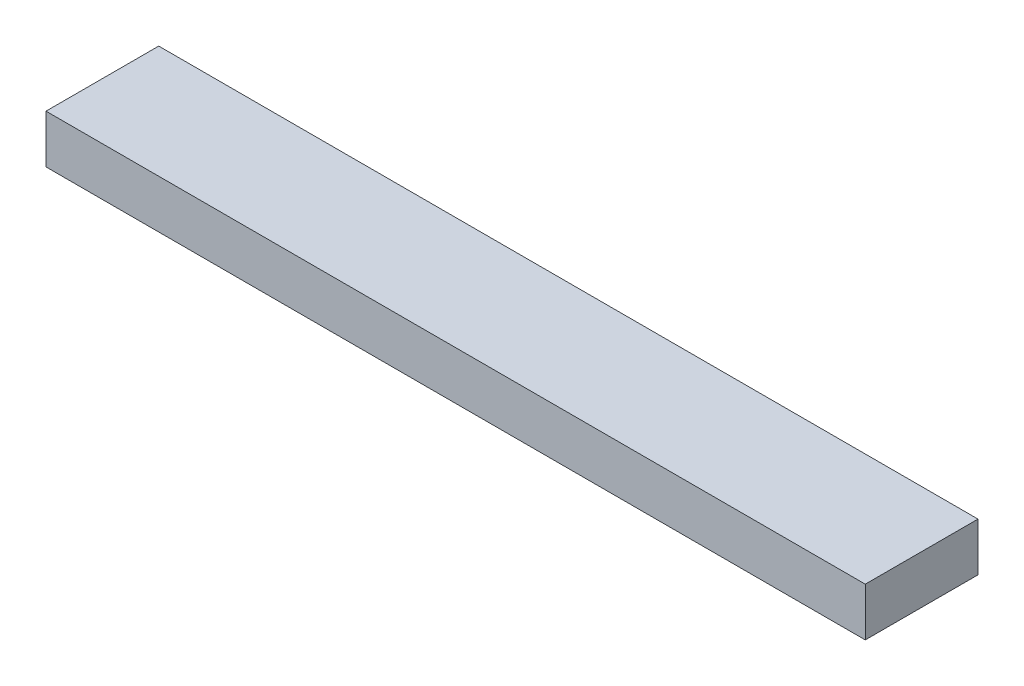
ISO-10303-21;
HEADER;
FILE_DESCRIPTION(('STEP AP214'),'2;1');
FILE_NAME('part.step','',(''),(''),'','','');
FILE_SCHEMA(('AUTOMOTIVE_DESIGN { 1 0 10303 214 1 1 1 1 }'));
ENDSEC;
DATA;
#1=APPLICATION_CONTEXT('core data for automotive mechanical design processes');
#2=APPLICATION_PROTOCOL_DEFINITION('international standard','automotive_design',2000,#1);
#3=PRODUCT_CONTEXT('',#1,'mechanical');
#4=PRODUCT('Part','Part','',(#3));
#5=PRODUCT_RELATED_PRODUCT_CATEGORY('part','',(#4));
#6=PRODUCT_DEFINITION_FORMATION('','',#4);
#7=PRODUCT_DEFINITION_CONTEXT('part definition',#1,'design');
#8=PRODUCT_DEFINITION('design','',#6,#7);
#9=PRODUCT_DEFINITION_SHAPE('','',#8);
#10=(LENGTH_UNIT() NAMED_UNIT(*) SI_UNIT(.MILLI.,.METRE.));
#11=(NAMED_UNIT(*) PLANE_ANGLE_UNIT() SI_UNIT($,.RADIAN.));
#12=(NAMED_UNIT(*) SI_UNIT($,.STERADIAN.) SOLID_ANGLE_UNIT());
#13=UNCERTAINTY_MEASURE_WITH_UNIT(LENGTH_MEASURE(1.E-05),#10,'distance_accuracy_value','');
#14=(GEOMETRIC_REPRESENTATION_CONTEXT(3) GLOBAL_UNCERTAINTY_ASSIGNED_CONTEXT((#13)) GLOBAL_UNIT_ASSIGNED_CONTEXT((#10,
#11,#12)) REPRESENTATION_CONTEXT('',''));
#15=CARTESIAN_POINT('',(0.,0.,0.));
#16=DIRECTION('',(0.,0.,1.));
#17=DIRECTION('',(1.,0.,0.));
#18=AXIS2_PLACEMENT_3D('',#15,#16,#17);
#19=CARTESIAN_POINT('',(0.,38.1,0.));
#20=DIRECTION('',(1.,0.,0.));
#21=DIRECTION('',(0.,0.,-1.));
#22=AXIS2_PLACEMENT_3D('',#19,#20,#21);
#23=PLANE('',#22);
#24=DIRECTION('',(0.,0.,1.));
#25=VECTOR('',#24,1.);
#26=CARTESIAN_POINT('',(0.,0.,0.));
#27=LINE('',#26,#25);
#28=CARTESIAN_POINT('',(0.,0.,-88.9));
#29=VERTEX_POINT('',#28);
#30=CARTESIAN_POINT('',(0.,0.,0.));
#31=VERTEX_POINT('',#30);
#32=EDGE_CURVE('E110',#29,#31,#27,.T.);
#33=ORIENTED_EDGE('',*,*,#32,.T.);
#34=DIRECTION('',(0.,-1.,0.));
#35=VECTOR('',#34,1.);
#36=CARTESIAN_POINT('',(0.,38.1,0.));
#37=LINE('',#36,#35);
#38=CARTESIAN_POINT('',(0.,38.1,0.));
#39=VERTEX_POINT('',#38);
#40=EDGE_CURVE('E11',#39,#31,#37,.T.);
#41=ORIENTED_EDGE('',*,*,#40,.F.);
#42=DIRECTION('',(0.,0.,1.));
#43=VECTOR('',#42,1.);
#44=CARTESIAN_POINT('',(0.,38.1,0.));
#45=LINE('',#44,#43);
#46=CARTESIAN_POINT('',(0.,38.1,-88.9));
#47=VERTEX_POINT('',#46);
#48=EDGE_CURVE('E93',#47,#39,#45,.T.);
#49=ORIENTED_EDGE('',*,*,#48,.F.);
#50=DIRECTION('',(0.,-1.,0.));
#51=VECTOR('',#50,1.);
#52=CARTESIAN_POINT('',(0.,38.1,-88.9));
#53=LINE('',#52,#51);
#54=EDGE_CURVE('E106',#47,#29,#53,.T.);
#55=ORIENTED_EDGE('',*,*,#54,.T.);
#56=EDGE_LOOP('',(#33,#41,#49,#55));
#57=FACE_BOUND('',#56,.T.);
#58=ADVANCED_FACE('F41',(#57),#23,.F.);
#59=CARTESIAN_POINT('',(0.,38.1,0.));
#60=DIRECTION('',(0.,0.,-1.));
#61=DIRECTION('',(-1.,0.,0.));
#62=AXIS2_PLACEMENT_3D('',#59,#60,#61);
#63=PLANE('',#62);
#64=DIRECTION('',(1.,0.,0.));
#65=VECTOR('',#64,1.);
#66=CARTESIAN_POINT('',(0.,0.,0.));
#67=LINE('',#66,#65);
#68=CARTESIAN_POINT('',(646.1125,0.,0.));
#69=VERTEX_POINT('',#68);
#70=EDGE_CURVE('E98',#31,#69,#67,.T.);
#71=ORIENTED_EDGE('',*,*,#70,.T.);
#72=DIRECTION('',(0.,-1.,0.));
#73=VECTOR('',#72,1.);
#74=CARTESIAN_POINT('',(646.1125,38.1,0.));
#75=LINE('',#74,#73);
#76=CARTESIAN_POINT('',(646.1125,38.1,0.));
#77=VERTEX_POINT('',#76);
#78=EDGE_CURVE('E50',#77,#69,#75,.T.);
#79=ORIENTED_EDGE('',*,*,#78,.F.);
#80=DIRECTION('',(1.,0.,0.));
#81=VECTOR('',#80,1.);
#82=CARTESIAN_POINT('',(0.,38.1,0.));
#83=LINE('',#82,#81);
#84=EDGE_CURVE('E88',#39,#77,#83,.T.);
#85=ORIENTED_EDGE('',*,*,#84,.F.);
#86=ORIENTED_EDGE('',*,*,#40,.T.);
#87=EDGE_LOOP('',(#71,#79,#85,#86));
#88=FACE_BOUND('',#87,.T.);
#89=ADVANCED_FACE('F97',(#88),#63,.F.);
#90=CARTESIAN_POINT('',(646.1125,38.1,0.));
#91=DIRECTION('',(-1.,0.,0.));
#92=DIRECTION('',(0.,0.,1.));
#93=AXIS2_PLACEMENT_3D('',#90,#91,#92);
#94=PLANE('',#93);
#95=DIRECTION('',(0.,0.,-1.));
#96=VECTOR('',#95,1.);
#97=CARTESIAN_POINT('',(646.1125,0.,0.));
#98=LINE('',#97,#96);
#99=CARTESIAN_POINT('',(646.1125,0.,-88.9));
#100=VERTEX_POINT('',#99);
#101=EDGE_CURVE('E75',#69,#100,#98,.T.);
#102=ORIENTED_EDGE('',*,*,#101,.T.);
#103=DIRECTION('',(0.,-1.,0.));
#104=VECTOR('',#103,1.);
#105=CARTESIAN_POINT('',(646.1125,38.1,-88.9));
#106=LINE('',#105,#104);
#107=CARTESIAN_POINT('',(646.1125,38.1,-88.9));
#108=VERTEX_POINT('',#107);
#109=EDGE_CURVE('E100',#108,#100,#106,.T.);
#110=ORIENTED_EDGE('',*,*,#109,.F.);
#111=DIRECTION('',(0.,0.,-1.));
#112=VECTOR('',#111,1.);
#113=CARTESIAN_POINT('',(646.1125,38.1,0.));
#114=LINE('',#113,#112);
#115=EDGE_CURVE('E91',#77,#108,#114,.T.);
#116=ORIENTED_EDGE('',*,*,#115,.F.);
#117=ORIENTED_EDGE('',*,*,#78,.T.);
#118=EDGE_LOOP('',(#102,#110,#116,#117));
#119=FACE_BOUND('',#118,.T.);
#120=ADVANCED_FACE('F101',(#119),#94,.F.);
#121=CARTESIAN_POINT('',(0.,38.1,-88.9));
#122=DIRECTION('',(0.,0.,1.));
#123=DIRECTION('',(1.,0.,0.));
#124=AXIS2_PLACEMENT_3D('',#121,#122,#123);
#125=PLANE('',#124);
#126=DIRECTION('',(-1.,0.,0.));
#127=VECTOR('',#126,1.);
#128=CARTESIAN_POINT('',(0.,0.,-88.9));
#129=LINE('',#128,#127);
#130=EDGE_CURVE('E81',#100,#29,#129,.T.);
#131=ORIENTED_EDGE('',*,*,#130,.T.);
#132=ORIENTED_EDGE('',*,*,#54,.F.);
#133=DIRECTION('',(-1.,0.,0.));
#134=VECTOR('',#133,1.);
#135=CARTESIAN_POINT('',(0.,38.1,-88.9));
#136=LINE('',#135,#134);
#137=EDGE_CURVE('E58',#108,#47,#136,.T.);
#138=ORIENTED_EDGE('',*,*,#137,.F.);
#139=ORIENTED_EDGE('',*,*,#109,.T.);
#140=EDGE_LOOP('',(#131,#132,#138,#139));
#141=FACE_BOUND('',#140,.T.);
#142=ADVANCED_FACE('F124',(#141),#125,.F.);
#143=CARTESIAN_POINT('',(0.,38.1,0.));
#144=DIRECTION('',(0.,-1.,0.));
#145=DIRECTION('',(0.,0.,-1.));
#146=AXIS2_PLACEMENT_3D('',#143,#144,#145);
#147=PLANE('',#146);
#148=ORIENTED_EDGE('',*,*,#48,.T.);
#149=ORIENTED_EDGE('',*,*,#84,.T.);
#150=ORIENTED_EDGE('',*,*,#115,.T.);
#151=ORIENTED_EDGE('',*,*,#137,.T.);
#152=EDGE_LOOP('',(#148,#149,#150,#151));
#153=FACE_BOUND('',#152,.T.);
#154=ADVANCED_FACE('F89',(#153),#147,.F.);
#155=CARTESIAN_POINT('',(0.,0.,0.));
#156=DIRECTION('',(0.,-1.,0.));
#157=DIRECTION('',(0.,0.,-1.));
#158=AXIS2_PLACEMENT_3D('',#155,#156,#157);
#159=PLANE('',#158);
#160=ORIENTED_EDGE('',*,*,#32,.F.);
#161=ORIENTED_EDGE('',*,*,#130,.F.);
#162=ORIENTED_EDGE('',*,*,#101,.F.);
#163=ORIENTED_EDGE('',*,*,#70,.F.);
#164=EDGE_LOOP('',(#160,#161,#162,#163));
#165=FACE_BOUND('',#164,.T.);
#166=ADVANCED_FACE('F127',(#165),#159,.T.);
#167=CLOSED_SHELL('',(#58,#89,#120,#142,#154,#166));
#168=MANIFOLD_SOLID_BREP('B2',#167);
#169=ADVANCED_BREP_SHAPE_REPRESENTATION('',(#18,#168),#14);
#170=SHAPE_DEFINITION_REPRESENTATION(#9,#169);
ENDSEC;
END-ISO-10303-21;
